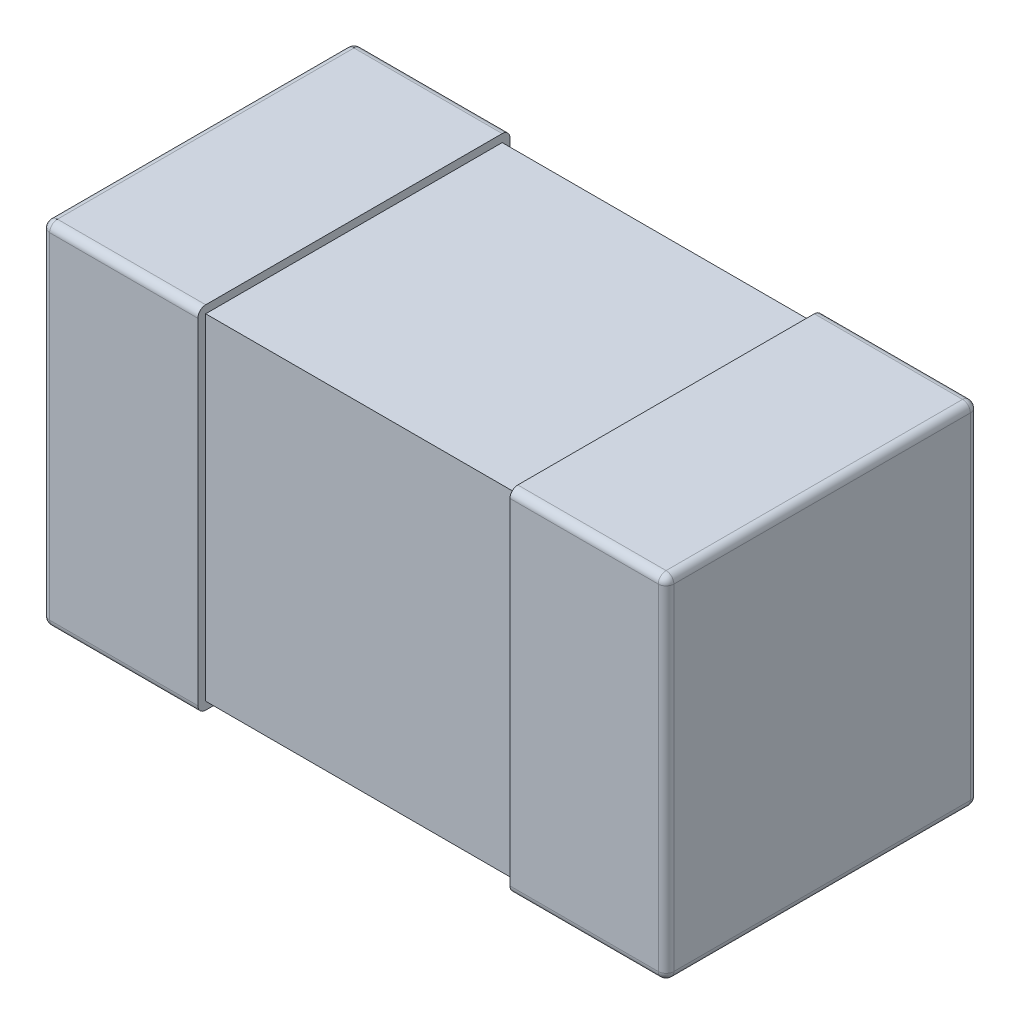
ISO-10303-21;
HEADER;
FILE_DESCRIPTION(('STEP AP214'),'2;1');
FILE_NAME('part.step','',(''),(''),'','','');
FILE_SCHEMA(('AUTOMOTIVE_DESIGN { 1 0 10303 214 1 1 1 1 }'));
ENDSEC;
DATA;
#1=APPLICATION_CONTEXT('core data for automotive mechanical design processes');
#2=APPLICATION_PROTOCOL_DEFINITION('international standard','automotive_design',2000,#1);
#3=PRODUCT_CONTEXT('',#1,'mechanical');
#4=PRODUCT('Part','Part','',(#3));
#5=PRODUCT_RELATED_PRODUCT_CATEGORY('part','',(#4));
#6=PRODUCT_DEFINITION_FORMATION('','',#4);
#7=PRODUCT_DEFINITION_CONTEXT('part definition',#1,'design');
#8=PRODUCT_DEFINITION('design','',#6,#7);
#9=PRODUCT_DEFINITION_SHAPE('','',#8);
#10=(LENGTH_UNIT() NAMED_UNIT(*) SI_UNIT(.MILLI.,.METRE.));
#11=(NAMED_UNIT(*) PLANE_ANGLE_UNIT() SI_UNIT($,.RADIAN.));
#12=(NAMED_UNIT(*) SI_UNIT($,.STERADIAN.) SOLID_ANGLE_UNIT());
#13=UNCERTAINTY_MEASURE_WITH_UNIT(LENGTH_MEASURE(1.E-05),#10,'distance_accuracy_value','');
#14=(GEOMETRIC_REPRESENTATION_CONTEXT(3) GLOBAL_UNCERTAINTY_ASSIGNED_CONTEXT((#13)) GLOBAL_UNIT_ASSIGNED_CONTEXT((#10,
#11,#12)) REPRESENTATION_CONTEXT('',''));
#15=CARTESIAN_POINT('',(0.,0.,0.));
#16=DIRECTION('',(0.,0.,1.));
#17=DIRECTION('',(1.,0.,0.));
#18=AXIS2_PLACEMENT_3D('',#15,#16,#17);
#19=CARTESIAN_POINT('',(-0.78,0.9,-0.38));
#20=DIRECTION('',(0.,-1.,0.));
#21=DIRECTION('',(0.,0.,-1.));
#22=AXIS2_PLACEMENT_3D('',#19,#20,#21);
#23=CYLINDRICAL_SURFACE('',#22,0.02);
#24=CARTESIAN_POINT('',(-0.78,0.88,-0.38));
#25=DIRECTION('',(0.,-1.,0.));
#26=DIRECTION('',(0.,0.,1.));
#27=AXIS2_PLACEMENT_3D('',#24,#25,#26);
#28=CIRCLE('',#27,0.02);
#29=CARTESIAN_POINT('',(-0.8,0.88,-0.38));
#30=VERTEX_POINT('',#29);
#31=CARTESIAN_POINT('',(-0.78,0.88,-0.4));
#32=VERTEX_POINT('',#31);
#33=EDGE_CURVE('P0_E26',#30,#32,#28,.T.);
#34=ORIENTED_EDGE('',*,*,#33,.T.);
#35=DIRECTION('',(0.,1.,0.));
#36=VECTOR('',#35,1.);
#37=CARTESIAN_POINT('',(-0.78,0.9,-0.4));
#38=LINE('',#37,#36);
#39=CARTESIAN_POINT('',(-0.78,0.02,-0.4));
#40=VERTEX_POINT('',#39);
#41=EDGE_CURVE('P0_E200',#40,#32,#38,.T.);
#42=ORIENTED_EDGE('',*,*,#41,.F.);
#43=CARTESIAN_POINT('',(-0.78,0.02,-0.38));
#44=DIRECTION('',(0.,1.,0.));
#45=DIRECTION('',(0.,0.,-1.));
#46=AXIS2_PLACEMENT_3D('',#43,#44,#45);
#47=CIRCLE('',#46,0.02);
#48=CARTESIAN_POINT('',(-0.8,0.02,-0.38));
#49=VERTEX_POINT('',#48);
#50=EDGE_CURVE('P0_E11',#40,#49,#47,.T.);
#51=ORIENTED_EDGE('',*,*,#50,.T.);
#52=DIRECTION('',(0.,-1.,0.));
#53=VECTOR('',#52,1.);
#54=CARTESIAN_POINT('',(-0.8,0.9,-0.38));
#55=LINE('',#54,#53);
#56=EDGE_CURVE('P0_E663',#30,#49,#55,.T.);
#57=ORIENTED_EDGE('',*,*,#56,.F.);
#58=EDGE_LOOP('',(#34,#42,#51,#57));
#59=FACE_BOUND('',#58,.T.);
#60=ADVANCED_FACE('P0_F16',(#59),#23,.T.);
#61=CARTESIAN_POINT('',(-0.78,0.02,-0.38));
#62=DIRECTION('',(0.,1.,0.));
#63=DIRECTION('',(1.,0.,0.));
#64=AXIS2_PLACEMENT_3D('',#61,#62,#63);
#65=SPHERICAL_SURFACE('',#64,0.02);
#66=CARTESIAN_POINT('',(-0.78,0.02,-0.38));
#67=DIRECTION('',(-1.,0.,0.));
#68=DIRECTION('',(0.,0.,1.));
#69=AXIS2_PLACEMENT_3D('',#66,#67,#68);
#70=CIRCLE('',#69,0.02);
#71=CARTESIAN_POINT('',(-0.78,0.,-0.38));
#72=VERTEX_POINT('',#71);
#73=EDGE_CURVE('P0_E40',#40,#72,#70,.T.);
#74=ORIENTED_EDGE('',*,*,#73,.T.);
#75=CARTESIAN_POINT('',(-0.78,0.02,-0.38));
#76=DIRECTION('',(0.,0.,-1.));
#77=DIRECTION('',(-1.,0.,0.));
#78=AXIS2_PLACEMENT_3D('',#75,#76,#77);
#79=CIRCLE('',#78,0.02);
#80=EDGE_CURVE('P0_E242',#72,#49,#79,.T.);
#81=ORIENTED_EDGE('',*,*,#80,.T.);
#82=ORIENTED_EDGE('',*,*,#50,.F.);
#83=EDGE_LOOP('',(#74,#81,#82));
#84=FACE_BOUND('',#83,.T.);
#85=ADVANCED_FACE('P0_F18',(#84),#65,.T.);
#86=CARTESIAN_POINT('',(-0.78,0.88,-0.38));
#87=DIRECTION('',(0.,1.,0.));
#88=DIRECTION('',(1.,0.,0.));
#89=AXIS2_PLACEMENT_3D('',#86,#87,#88);
#90=SPHERICAL_SURFACE('',#89,0.02);
#91=CARTESIAN_POINT('',(-0.78,0.88,-0.38));
#92=DIRECTION('',(0.,0.,-1.));
#93=DIRECTION('',(0.,1.,0.));
#94=AXIS2_PLACEMENT_3D('',#91,#92,#93);
#95=CIRCLE('',#94,0.02);
#96=CARTESIAN_POINT('',(-0.78,0.9,-0.38));
#97=VERTEX_POINT('',#96);
#98=EDGE_CURVE('P0_E20',#30,#97,#95,.T.);
#99=ORIENTED_EDGE('',*,*,#98,.T.);
#100=CARTESIAN_POINT('',(-0.78,0.88,-0.38));
#101=DIRECTION('',(-1.,0.,0.));
#102=DIRECTION('',(0.,0.,1.));
#103=AXIS2_PLACEMENT_3D('',#100,#101,#102);
#104=CIRCLE('',#103,0.02);
#105=EDGE_CURVE('P0_E236',#97,#32,#104,.T.);
#106=ORIENTED_EDGE('',*,*,#105,.T.);
#107=ORIENTED_EDGE('',*,*,#33,.F.);
#108=EDGE_LOOP('',(#99,#106,#107));
#109=FACE_BOUND('',#108,.T.);
#110=ADVANCED_FACE('P0_F382',(#109),#90,.T.);
#111=CARTESIAN_POINT('',(-0.8,0.02,-0.38));
#112=DIRECTION('',(1.,0.,0.));
#113=DIRECTION('',(0.,0.,-1.));
#114=AXIS2_PLACEMENT_3D('',#111,#112,#113);
#115=CYLINDRICAL_SURFACE('',#114,0.02);
#116=CARTESIAN_POINT('',(-0.4,0.02,-0.38));
#117=DIRECTION('',(1.,0.,0.));
#118=DIRECTION('',(0.,0.,1.));
#119=AXIS2_PLACEMENT_3D('',#116,#117,#118);
#120=CIRCLE('',#119,0.02);
#121=CARTESIAN_POINT('',(-0.4,0.,-0.38));
#122=VERTEX_POINT('',#121);
#123=CARTESIAN_POINT('',(-0.4,0.02,-0.4));
#124=VERTEX_POINT('',#123);
#125=EDGE_CURVE('P0_E241',#122,#124,#120,.T.);
#126=ORIENTED_EDGE('',*,*,#125,.F.);
#127=DIRECTION('',(1.,0.,0.));
#128=VECTOR('',#127,1.);
#129=CARTESIAN_POINT('',(-0.4,0.,-0.38));
#130=LINE('',#129,#128);
#131=EDGE_CURVE('P0_E205',#72,#122,#130,.T.);
#132=ORIENTED_EDGE('',*,*,#131,.F.);
#133=ORIENTED_EDGE('',*,*,#73,.F.);
#134=DIRECTION('',(-1.,0.,0.));
#135=VECTOR('',#134,1.);
#136=CARTESIAN_POINT('',(-0.8,0.02,-0.4));
#137=LINE('',#136,#135);
#138=EDGE_CURVE('P0_E154',#124,#40,#137,.T.);
#139=ORIENTED_EDGE('',*,*,#138,.F.);
#140=EDGE_LOOP('',(#126,#132,#133,#139));
#141=FACE_BOUND('',#140,.T.);
#142=ADVANCED_FACE('P0_F273',(#141),#115,.T.);
#143=CARTESIAN_POINT('',(-0.78,0.02,0.4));
#144=DIRECTION('',(0.,0.,-1.));
#145=DIRECTION('',(-1.,0.,0.));
#146=AXIS2_PLACEMENT_3D('',#143,#144,#145);
#147=CYLINDRICAL_SURFACE('',#146,0.02);
#148=CARTESIAN_POINT('',(-0.78,0.02,0.38));
#149=DIRECTION('',(0.,0.,-1.));
#150=DIRECTION('',(1.,0.,0.));
#151=AXIS2_PLACEMENT_3D('',#148,#149,#150);
#152=CIRCLE('',#151,0.02);
#153=CARTESIAN_POINT('',(-0.78,0.,0.38));
#154=VERTEX_POINT('',#153);
#155=CARTESIAN_POINT('',(-0.8,0.02,0.38));
#156=VERTEX_POINT('',#155);
#157=EDGE_CURVE('P0_E54',#154,#156,#152,.T.);
#158=ORIENTED_EDGE('',*,*,#157,.T.);
#159=DIRECTION('',(0.,0.,1.));
#160=VECTOR('',#159,1.);
#161=CARTESIAN_POINT('',(-0.8,0.02,0.4));
#162=LINE('',#161,#160);
#163=EDGE_CURVE('P0_E184',#49,#156,#162,.T.);
#164=ORIENTED_EDGE('',*,*,#163,.F.);
#165=ORIENTED_EDGE('',*,*,#80,.F.);
#166=DIRECTION('',(0.,0.,-1.));
#167=VECTOR('',#166,1.);
#168=CARTESIAN_POINT('',(-0.78,0.,-0.4));
#169=LINE('',#168,#167);
#170=EDGE_CURVE('P0_E207',#154,#72,#169,.T.);
#171=ORIENTED_EDGE('',*,*,#170,.F.);
#172=EDGE_LOOP('',(#158,#164,#165,#171));
#173=FACE_BOUND('',#172,.T.);
#174=ADVANCED_FACE('P0_F268',(#173),#147,.T.);
#175=CARTESIAN_POINT('',(-0.78,0.88,0.));
#176=DIRECTION('',(0.,0.,1.));
#177=DIRECTION('',(1.,0.,0.));
#178=AXIS2_PLACEMENT_3D('',#175,#176,#177);
#179=CYLINDRICAL_SURFACE('',#178,0.02);
#180=CARTESIAN_POINT('',(-0.78,0.88,0.38));
#181=DIRECTION('',(0.,0.,-1.));
#182=DIRECTION('',(1.,0.,0.));
#183=AXIS2_PLACEMENT_3D('',#180,#181,#182);
#184=CIRCLE('',#183,0.02);
#185=CARTESIAN_POINT('',(-0.8,0.88,0.38));
#186=VERTEX_POINT('',#185);
#187=CARTESIAN_POINT('',(-0.78,0.9,0.38));
#188=VERTEX_POINT('',#187);
#189=EDGE_CURVE('P0_E75',#186,#188,#184,.T.);
#190=ORIENTED_EDGE('',*,*,#189,.T.);
#191=DIRECTION('',(0.,0.,1.));
#192=VECTOR('',#191,1.);
#193=CARTESIAN_POINT('',(-0.78,0.9,0.));
#194=LINE('',#193,#192);
#195=EDGE_CURVE('P0_E218',#97,#188,#194,.T.);
#196=ORIENTED_EDGE('',*,*,#195,.F.);
#197=ORIENTED_EDGE('',*,*,#98,.F.);
#198=DIRECTION('',(0.,0.,-1.));
#199=VECTOR('',#198,1.);
#200=CARTESIAN_POINT('',(-0.8,0.88,0.4));
#201=LINE('',#200,#199);
#202=EDGE_CURVE('P0_E697',#186,#30,#201,.T.);
#203=ORIENTED_EDGE('',*,*,#202,.F.);
#204=EDGE_LOOP('',(#190,#196,#197,#203));
#205=FACE_BOUND('',#204,.T.);
#206=ADVANCED_FACE('P0_F442',(#205),#179,.T.);
#207=CARTESIAN_POINT('',(0.,0.88,-0.38));
#208=DIRECTION('',(-1.,0.,0.));
#209=DIRECTION('',(0.,0.,1.));
#210=AXIS2_PLACEMENT_3D('',#207,#208,#209);
#211=CYLINDRICAL_SURFACE('',#210,0.02);
#212=CARTESIAN_POINT('',(-0.4,0.88,-0.38));
#213=DIRECTION('',(1.,0.,0.));
#214=DIRECTION('',(0.,0.,1.));
#215=AXIS2_PLACEMENT_3D('',#212,#213,#214);
#216=CIRCLE('',#215,0.02);
#217=CARTESIAN_POINT('',(-0.4,0.88,-0.4));
#218=VERTEX_POINT('',#217);
#219=CARTESIAN_POINT('',(-0.4,0.9,-0.38));
#220=VERTEX_POINT('',#219);
#221=EDGE_CURVE('P0_E185',#218,#220,#216,.T.);
#222=ORIENTED_EDGE('',*,*,#221,.F.);
#223=DIRECTION('',(1.,0.,0.));
#224=VECTOR('',#223,1.);
#225=CARTESIAN_POINT('',(-0.8,0.88,-0.4));
#226=LINE('',#225,#224);
#227=EDGE_CURVE('P0_E204',#32,#218,#226,.T.);
#228=ORIENTED_EDGE('',*,*,#227,.F.);
#229=ORIENTED_EDGE('',*,*,#105,.F.);
#230=DIRECTION('',(-1.,0.,0.));
#231=VECTOR('',#230,1.);
#232=CARTESIAN_POINT('',(0.,0.9,-0.38));
#233=LINE('',#232,#231);
#234=EDGE_CURVE('P0_E209',#220,#97,#233,.T.);
#235=ORIENTED_EDGE('',*,*,#234,.F.);
#236=EDGE_LOOP('',(#222,#228,#229,#235));
#237=FACE_BOUND('',#236,.T.);
#238=ADVANCED_FACE('P0_F437',(#237),#211,.T.);
#239=CARTESIAN_POINT('',(-0.78,0.02,0.38));
#240=DIRECTION('',(0.,1.,0.));
#241=DIRECTION('',(1.,0.,0.));
#242=AXIS2_PLACEMENT_3D('',#239,#240,#241);
#243=SPHERICAL_SURFACE('',#242,0.02);
#244=CARTESIAN_POINT('',(-0.78,0.02,0.38));
#245=DIRECTION('',(-1.,0.,0.));
#246=DIRECTION('',(0.,0.,1.));
#247=AXIS2_PLACEMENT_3D('',#244,#245,#246);
#248=CIRCLE('',#247,0.02);
#249=CARTESIAN_POINT('',(-0.78,0.02,0.4));
#250=VERTEX_POINT('',#249);
#251=EDGE_CURVE('P0_E191',#154,#250,#248,.T.);
#252=ORIENTED_EDGE('',*,*,#251,.T.);
#253=CARTESIAN_POINT('',(-0.78,0.02,0.38));
#254=DIRECTION('',(0.,-1.,0.));
#255=DIRECTION('',(0.,0.,-1.));
#256=AXIS2_PLACEMENT_3D('',#253,#254,#255);
#257=CIRCLE('',#256,0.02);
#258=EDGE_CURVE('P0_E248',#250,#156,#257,.T.);
#259=ORIENTED_EDGE('',*,*,#258,.T.);
#260=ORIENTED_EDGE('',*,*,#157,.F.);
#261=EDGE_LOOP('',(#252,#259,#260));
#262=FACE_BOUND('',#261,.T.);
#263=ADVANCED_FACE('P0_F441',(#262),#243,.T.);
#264=CARTESIAN_POINT('',(-0.78,0.88,0.38));
#265=DIRECTION('',(0.,1.,0.));
#266=DIRECTION('',(1.,0.,0.));
#267=AXIS2_PLACEMENT_3D('',#264,#265,#266);
#268=SPHERICAL_SURFACE('',#267,0.02);
#269=CARTESIAN_POINT('',(-0.78,0.88,0.38));
#270=DIRECTION('',(0.,1.,0.));
#271=DIRECTION('',(0.,0.,1.));
#272=AXIS2_PLACEMENT_3D('',#269,#270,#271);
#273=CIRCLE('',#272,0.02);
#274=CARTESIAN_POINT('',(-0.78,0.88,0.4));
#275=VERTEX_POINT('',#274);
#276=EDGE_CURVE('P0_E194',#186,#275,#273,.T.);
#277=ORIENTED_EDGE('',*,*,#276,.T.);
#278=CARTESIAN_POINT('',(-0.78,0.88,0.38));
#279=DIRECTION('',(-1.,0.,0.));
#280=DIRECTION('',(0.,0.,1.));
#281=AXIS2_PLACEMENT_3D('',#278,#279,#280);
#282=CIRCLE('',#281,0.02);
#283=EDGE_CURVE('P0_E245',#275,#188,#282,.T.);
#284=ORIENTED_EDGE('',*,*,#283,.T.);
#285=ORIENTED_EDGE('',*,*,#189,.F.);
#286=EDGE_LOOP('',(#277,#284,#285));
#287=FACE_BOUND('',#286,.T.);
#288=ADVANCED_FACE('P0_F463',(#287),#268,.T.);
#289=CARTESIAN_POINT('',(-0.8,0.02,0.38));
#290=DIRECTION('',(-1.,0.,0.));
#291=DIRECTION('',(0.,0.,1.));
#292=AXIS2_PLACEMENT_3D('',#289,#290,#291);
#293=CYLINDRICAL_SURFACE('',#292,0.02);
#294=CARTESIAN_POINT('',(-0.4,0.02,0.38));
#295=DIRECTION('',(1.,0.,0.));
#296=DIRECTION('',(0.,0.,1.));
#297=AXIS2_PLACEMENT_3D('',#294,#295,#296);
#298=CIRCLE('',#297,0.02);
#299=CARTESIAN_POINT('',(-0.4,0.02,0.4));
#300=VERTEX_POINT('',#299);
#301=CARTESIAN_POINT('',(-0.4,0.,0.38));
#302=VERTEX_POINT('',#301);
#303=EDGE_CURVE('P0_E142',#300,#302,#298,.T.);
#304=ORIENTED_EDGE('',*,*,#303,.F.);
#305=DIRECTION('',(1.,0.,0.));
#306=VECTOR('',#305,1.);
#307=CARTESIAN_POINT('',(-0.4,0.02,0.4));
#308=LINE('',#307,#306);
#309=EDGE_CURVE('P0_E146',#250,#300,#308,.T.);
#310=ORIENTED_EDGE('',*,*,#309,.F.);
#311=ORIENTED_EDGE('',*,*,#251,.F.);
#312=DIRECTION('',(-1.,0.,0.));
#313=VECTOR('',#312,1.);
#314=CARTESIAN_POINT('',(-0.8,0.,0.38));
#315=LINE('',#314,#313);
#316=EDGE_CURVE('P0_E149',#302,#154,#315,.T.);
#317=ORIENTED_EDGE('',*,*,#316,.F.);
#318=EDGE_LOOP('',(#304,#310,#311,#317));
#319=FACE_BOUND('',#318,.T.);
#320=ADVANCED_FACE('P0_F144',(#319),#293,.T.);
#321=CARTESIAN_POINT('',(-0.78,0.9,0.38));
#322=DIRECTION('',(0.,-1.,0.));
#323=DIRECTION('',(0.,0.,-1.));
#324=AXIS2_PLACEMENT_3D('',#321,#322,#323);
#325=CYLINDRICAL_SURFACE('',#324,0.02);
#326=ORIENTED_EDGE('',*,*,#258,.F.);
#327=DIRECTION('',(0.,-1.,0.));
#328=VECTOR('',#327,1.);
#329=CARTESIAN_POINT('',(-0.78,0.9,0.4));
#330=LINE('',#329,#328);
#331=EDGE_CURVE('P0_E170',#275,#250,#330,.T.);
#332=ORIENTED_EDGE('',*,*,#331,.F.);
#333=ORIENTED_EDGE('',*,*,#276,.F.);
#334=DIRECTION('',(0.,1.,0.));
#335=VECTOR('',#334,1.);
#336=CARTESIAN_POINT('',(-0.8,0.9,0.38));
#337=LINE('',#336,#335);
#338=EDGE_CURVE('P0_E177',#156,#186,#337,.T.);
#339=ORIENTED_EDGE('',*,*,#338,.F.);
#340=EDGE_LOOP('',(#326,#332,#333,#339));
#341=FACE_BOUND('',#340,.T.);
#342=ADVANCED_FACE('P0_F420',(#341),#325,.T.);
#343=CARTESIAN_POINT('',(0.,0.88,0.38));
#344=DIRECTION('',(1.,0.,0.));
#345=DIRECTION('',(0.,0.,-1.));
#346=AXIS2_PLACEMENT_3D('',#343,#344,#345);
#347=CYLINDRICAL_SURFACE('',#346,0.02);
#348=CARTESIAN_POINT('',(-0.4,0.88,0.38));
#349=DIRECTION('',(1.,0.,0.));
#350=DIRECTION('',(0.,0.,1.));
#351=AXIS2_PLACEMENT_3D('',#348,#349,#350);
#352=CIRCLE('',#351,0.02);
#353=CARTESIAN_POINT('',(-0.4,0.9,0.38));
#354=VERTEX_POINT('',#353);
#355=CARTESIAN_POINT('',(-0.4,0.88,0.4));
#356=VERTEX_POINT('',#355);
#357=EDGE_CURVE('P0_E155',#354,#356,#352,.T.);
#358=ORIENTED_EDGE('',*,*,#357,.F.);
#359=DIRECTION('',(1.,0.,0.));
#360=VECTOR('',#359,1.);
#361=CARTESIAN_POINT('',(0.,0.9,0.38));
#362=LINE('',#361,#360);
#363=EDGE_CURVE('P0_E226',#188,#354,#362,.T.);
#364=ORIENTED_EDGE('',*,*,#363,.F.);
#365=ORIENTED_EDGE('',*,*,#283,.F.);
#366=DIRECTION('',(-1.,0.,0.));
#367=VECTOR('',#366,1.);
#368=CARTESIAN_POINT('',(-0.8,0.88,0.4));
#369=LINE('',#368,#367);
#370=EDGE_CURVE('P0_E166',#356,#275,#369,.T.);
#371=ORIENTED_EDGE('',*,*,#370,.F.);
#372=EDGE_LOOP('',(#358,#364,#365,#371));
#373=FACE_BOUND('',#372,.T.);
#374=ADVANCED_FACE('P0_F416',(#373),#347,.T.);
#375=CARTESIAN_POINT('',(0.,0.,0.));
#376=DIRECTION('',(0.,-1.,0.));
#377=DIRECTION('',(0.,0.,-1.));
#378=AXIS2_PLACEMENT_3D('',#375,#376,#377);
#379=PLANE('',#378);
#380=ORIENTED_EDGE('',*,*,#170,.T.);
#381=ORIENTED_EDGE('',*,*,#131,.T.);
#382=DIRECTION('',(0.,0.,-1.));
#383=VECTOR('',#382,1.);
#384=CARTESIAN_POINT('',(-0.4,0.,0.4));
#385=LINE('',#384,#383);
#386=EDGE_CURVE('P0_E233',#302,#122,#385,.T.);
#387=ORIENTED_EDGE('',*,*,#386,.F.);
#388=ORIENTED_EDGE('',*,*,#316,.T.);
#389=EDGE_LOOP('',(#380,#381,#387,#388));
#390=FACE_BOUND('',#389,.T.);
#391=ADVANCED_FACE('P0_F264',(#390),#379,.T.);
#392=CARTESIAN_POINT('',(0.,0.9,0.));
#393=DIRECTION('',(0.,-1.,0.));
#394=DIRECTION('',(0.,0.,-1.));
#395=AXIS2_PLACEMENT_3D('',#392,#393,#394);
#396=PLANE('',#395);
#397=DIRECTION('',(0.,0.,-1.));
#398=VECTOR('',#397,1.);
#399=CARTESIAN_POINT('',(-0.4,0.9,0.4));
#400=LINE('',#399,#398);
#401=EDGE_CURVE('P0_E188',#354,#220,#400,.T.);
#402=ORIENTED_EDGE('',*,*,#401,.T.);
#403=ORIENTED_EDGE('',*,*,#234,.T.);
#404=ORIENTED_EDGE('',*,*,#195,.T.);
#405=ORIENTED_EDGE('',*,*,#363,.T.);
#406=EDGE_LOOP('',(#402,#403,#404,#405));
#407=FACE_BOUND('',#406,.T.);
#408=ADVANCED_FACE('P0_F479',(#407),#396,.F.);
#409=CARTESIAN_POINT('',(-0.8,0.9,-0.4));
#410=DIRECTION('',(0.,0.,1.));
#411=DIRECTION('',(1.,0.,0.));
#412=AXIS2_PLACEMENT_3D('',#409,#410,#411);
#413=PLANE('',#412);
#414=DIRECTION('',(0.,-1.,0.));
#415=VECTOR('',#414,1.);
#416=CARTESIAN_POINT('',(-0.4,0.9,-0.4));
#417=LINE('',#416,#415);
#418=EDGE_CURVE('P0_E189',#218,#124,#417,.T.);
#419=ORIENTED_EDGE('',*,*,#418,.T.);
#420=ORIENTED_EDGE('',*,*,#138,.T.);
#421=ORIENTED_EDGE('',*,*,#41,.T.);
#422=ORIENTED_EDGE('',*,*,#227,.T.);
#423=EDGE_LOOP('',(#419,#420,#421,#422));
#424=FACE_BOUND('',#423,.T.);
#425=ADVANCED_FACE('P0_F453',(#424),#413,.F.);
#426=CARTESIAN_POINT('',(-0.4,0.9,0.4));
#427=DIRECTION('',(-1.,0.,0.));
#428=DIRECTION('',(0.,0.,1.));
#429=AXIS2_PLACEMENT_3D('',#426,#427,#428);
#430=PLANE('',#429);
#431=ORIENTED_EDGE('',*,*,#386,.T.);
#432=ORIENTED_EDGE('',*,*,#125,.T.);
#433=ORIENTED_EDGE('',*,*,#418,.F.);
#434=ORIENTED_EDGE('',*,*,#221,.T.);
#435=ORIENTED_EDGE('',*,*,#401,.F.);
#436=ORIENTED_EDGE('',*,*,#357,.T.);
#437=DIRECTION('',(0.,-1.,0.));
#438=VECTOR('',#437,1.);
#439=CARTESIAN_POINT('',(-0.4,0.9,0.4));
#440=LINE('',#439,#438);
#441=EDGE_CURVE('P0_E158',#356,#300,#440,.T.);
#442=ORIENTED_EDGE('',*,*,#441,.T.);
#443=ORIENTED_EDGE('',*,*,#303,.T.);
#444=EDGE_LOOP('',(#431,#432,#433,#434,#435,#436,#442,#443));
#445=FACE_BOUND('',#444,.T.);
#446=ADVANCED_FACE('P0_F159',(#445),#430,.F.);
#447=CARTESIAN_POINT('',(-0.8,0.9,0.4));
#448=DIRECTION('',(0.,0.,-1.));
#449=DIRECTION('',(0.,-1.,0.));
#450=AXIS2_PLACEMENT_3D('',#447,#448,#449);
#451=PLANE('',#450);
#452=ORIENTED_EDGE('',*,*,#331,.T.);
#453=ORIENTED_EDGE('',*,*,#309,.T.);
#454=ORIENTED_EDGE('',*,*,#441,.F.);
#455=ORIENTED_EDGE('',*,*,#370,.T.);
#456=EDGE_LOOP('',(#452,#453,#454,#455));
#457=FACE_BOUND('',#456,.T.);
#458=ADVANCED_FACE('P0_F168',(#457),#451,.F.);
#459=CARTESIAN_POINT('',(-0.8,0.9,0.4));
#460=DIRECTION('',(1.,0.,0.));
#461=DIRECTION('',(0.,1.,0.));
#462=AXIS2_PLACEMENT_3D('',#459,#460,#461);
#463=PLANE('',#462);
#464=ORIENTED_EDGE('',*,*,#202,.T.);
#465=ORIENTED_EDGE('',*,*,#56,.T.);
#466=ORIENTED_EDGE('',*,*,#163,.T.);
#467=ORIENTED_EDGE('',*,*,#338,.T.);
#468=EDGE_LOOP('',(#464,#465,#466,#467));
#469=FACE_BOUND('',#468,.T.);
#470=ADVANCED_FACE('P0_F391',(#469),#463,.F.);
#471=CLOSED_SHELL('',(#60,#85,#110,#142,#174,#206,#238,#263,#288,#320,#342,#374,#391,#408,#425,
#446,#458,#470));
#472=MANIFOLD_SOLID_BREP('P0_B1',#471);
#473=CARTESIAN_POINT('',(0.78,0.9,-0.38));
#474=DIRECTION('',(0.,-1.,0.));
#475=DIRECTION('',(0.,0.,-1.));
#476=AXIS2_PLACEMENT_3D('',#473,#474,#475);
#477=CYLINDRICAL_SURFACE('',#476,0.02);
#478=CARTESIAN_POINT('',(0.78,0.88,-0.38));
#479=DIRECTION('',(0.,1.,0.));
#480=DIRECTION('',(0.,0.,1.));
#481=AXIS2_PLACEMENT_3D('',#478,#479,#480);
#482=CIRCLE('',#481,0.02);
#483=CARTESIAN_POINT('',(0.8,0.88,-0.38));
#484=VERTEX_POINT('',#483);
#485=CARTESIAN_POINT('',(0.78,0.88,-0.4));
#486=VERTEX_POINT('',#485);
#487=EDGE_CURVE('P1_E27',#484,#486,#482,.T.);
#488=ORIENTED_EDGE('',*,*,#487,.F.);
#489=DIRECTION('',(0.,-1.,0.));
#490=VECTOR('',#489,1.);
#491=CARTESIAN_POINT('',(0.8,0.9,-0.38));
#492=LINE('',#491,#490);
#493=CARTESIAN_POINT('',(0.8,0.02,-0.38));
#494=VERTEX_POINT('',#493);
#495=EDGE_CURVE('P1_E181',#484,#494,#492,.T.);
#496=ORIENTED_EDGE('',*,*,#495,.T.);
#497=CARTESIAN_POINT('',(0.78,0.02,-0.38));
#498=DIRECTION('',(0.,-1.,0.));
#499=DIRECTION('',(0.,0.,-1.));
#500=AXIS2_PLACEMENT_3D('',#497,#498,#499);
#501=CIRCLE('',#500,0.02);
#502=CARTESIAN_POINT('',(0.78,0.02,-0.4));
#503=VERTEX_POINT('',#502);
#504=EDGE_CURVE('P1_E11',#503,#494,#501,.T.);
#505=ORIENTED_EDGE('',*,*,#504,.F.);
#506=DIRECTION('',(0.,1.,0.));
#507=VECTOR('',#506,1.);
#508=CARTESIAN_POINT('',(0.78,0.9,-0.4));
#509=LINE('',#508,#507);
#510=EDGE_CURVE('P1_E159',#503,#486,#509,.T.);
#511=ORIENTED_EDGE('',*,*,#510,.T.);
#512=EDGE_LOOP('',(#488,#496,#505,#511));
#513=FACE_BOUND('',#512,.T.);
#514=ADVANCED_FACE('P1_F16',(#513),#477,.T.);
#515=CARTESIAN_POINT('',(0.78,0.02,-0.38));
#516=DIRECTION('',(0.,-1.,0.));
#517=DIRECTION('',(-1.,0.,0.));
#518=AXIS2_PLACEMENT_3D('',#515,#516,#517);
#519=SPHERICAL_SURFACE('',#518,0.02);
#520=CARTESIAN_POINT('',(0.78,0.02,-0.38));
#521=DIRECTION('',(-1.,0.,0.));
#522=DIRECTION('',(0.,0.,1.));
#523=AXIS2_PLACEMENT_3D('',#520,#521,#522);
#524=CIRCLE('',#523,0.02);
#525=CARTESIAN_POINT('',(0.78,0.,-0.38));
#526=VERTEX_POINT('',#525);
#527=EDGE_CURVE('P1_E42',#503,#526,#524,.T.);
#528=ORIENTED_EDGE('',*,*,#527,.F.);
#529=ORIENTED_EDGE('',*,*,#504,.T.);
#530=CARTESIAN_POINT('',(0.78,0.02,-0.38));
#531=DIRECTION('',(0.,0.,1.));
#532=DIRECTION('',(1.,0.,0.));
#533=AXIS2_PLACEMENT_3D('',#530,#531,#532);
#534=CIRCLE('',#533,0.02);
#535=EDGE_CURVE('P1_E198',#526,#494,#534,.T.);
#536=ORIENTED_EDGE('',*,*,#535,.F.);
#537=EDGE_LOOP('',(#528,#529,#536));
#538=FACE_BOUND('',#537,.T.);
#539=ADVANCED_FACE('P1_F403',(#538),#519,.T.);
#540=CARTESIAN_POINT('',(0.78,0.88,-0.38));
#541=DIRECTION('',(0.,-1.,0.));
#542=DIRECTION('',(-1.,0.,0.));
#543=AXIS2_PLACEMENT_3D('',#540,#541,#542);
#544=SPHERICAL_SURFACE('',#543,0.02);
#545=CARTESIAN_POINT('',(0.78,0.88,-0.38));
#546=DIRECTION('',(0.,0.,1.));
#547=DIRECTION('',(0.,1.,0.));
#548=AXIS2_PLACEMENT_3D('',#545,#546,#547);
#549=CIRCLE('',#548,0.02);
#550=CARTESIAN_POINT('',(0.78,0.9,-0.38));
#551=VERTEX_POINT('',#550);
#552=EDGE_CURVE('P1_E141',#484,#551,#549,.T.);
#553=ORIENTED_EDGE('',*,*,#552,.F.);
#554=ORIENTED_EDGE('',*,*,#487,.T.);
#555=CARTESIAN_POINT('',(0.78,0.88,-0.38));
#556=DIRECTION('',(-1.,0.,0.));
#557=DIRECTION('',(0.,0.,1.));
#558=AXIS2_PLACEMENT_3D('',#555,#556,#557);
#559=CIRCLE('',#558,0.02);
#560=EDGE_CURVE('P1_E193',#551,#486,#559,.T.);
#561=ORIENTED_EDGE('',*,*,#560,.F.);
#562=EDGE_LOOP('',(#553,#554,#561));
#563=FACE_BOUND('',#562,.T.);
#564=ADVANCED_FACE('P1_F308',(#563),#544,.T.);
#565=CARTESIAN_POINT('',(0.8,0.02,-0.38));
#566=DIRECTION('',(-1.,0.,0.));
#567=DIRECTION('',(0.,0.,-1.));
#568=AXIS2_PLACEMENT_3D('',#565,#566,#567);
#569=CYLINDRICAL_SURFACE('',#568,0.02);
#570=CARTESIAN_POINT('',(0.4,0.02,-0.38));
#571=DIRECTION('',(1.,0.,0.));
#572=DIRECTION('',(0.,0.,1.));
#573=AXIS2_PLACEMENT_3D('',#570,#571,#572);
#574=CIRCLE('',#573,0.02);
#575=CARTESIAN_POINT('',(0.4,0.,-0.38));
#576=VERTEX_POINT('',#575);
#577=CARTESIAN_POINT('',(0.4,0.02,-0.4));
#578=VERTEX_POINT('',#577);
#579=EDGE_CURVE('P1_E202',#576,#578,#574,.T.);
#580=ORIENTED_EDGE('',*,*,#579,.T.);
#581=DIRECTION('',(1.,0.,0.));
#582=VECTOR('',#581,1.);
#583=CARTESIAN_POINT('',(0.8,0.02,-0.4));
#584=LINE('',#583,#582);
#585=EDGE_CURVE('P1_E153',#578,#503,#584,.T.);
#586=ORIENTED_EDGE('',*,*,#585,.T.);
#587=ORIENTED_EDGE('',*,*,#527,.T.);
#588=DIRECTION('',(-1.,0.,0.));
#589=VECTOR('',#588,1.);
#590=CARTESIAN_POINT('',(0.4,0.,-0.38));
#591=LINE('',#590,#589);
#592=EDGE_CURVE('P1_E135',#526,#576,#591,.T.);
#593=ORIENTED_EDGE('',*,*,#592,.T.);
#594=EDGE_LOOP('',(#580,#586,#587,#593));
#595=FACE_BOUND('',#594,.T.);
#596=ADVANCED_FACE('P1_F278',(#595),#569,.T.);
#597=CARTESIAN_POINT('',(0.78,0.02,0.4));
#598=DIRECTION('',(0.,0.,-1.));
#599=DIRECTION('',(1.,0.,0.));
#600=AXIS2_PLACEMENT_3D('',#597,#598,#599);
#601=CYLINDRICAL_SURFACE('',#600,0.02);
#602=CARTESIAN_POINT('',(0.78,0.02,0.38));
#603=DIRECTION('',(0.,0.,1.));
#604=DIRECTION('',(-1.,0.,0.));
#605=AXIS2_PLACEMENT_3D('',#602,#603,#604);
#606=CIRCLE('',#605,0.02);
#607=CARTESIAN_POINT('',(0.78,0.,0.38));
#608=VERTEX_POINT('',#607);
#609=CARTESIAN_POINT('',(0.8,0.02,0.38));
#610=VERTEX_POINT('',#609);
#611=EDGE_CURVE('P1_E20',#608,#610,#606,.T.);
#612=ORIENTED_EDGE('',*,*,#611,.F.);
#613=DIRECTION('',(0.,0.,-1.));
#614=VECTOR('',#613,1.);
#615=CARTESIAN_POINT('',(0.78,0.,-0.4));
#616=LINE('',#615,#614);
#617=EDGE_CURVE('P1_E172',#608,#526,#616,.T.);
#618=ORIENTED_EDGE('',*,*,#617,.T.);
#619=ORIENTED_EDGE('',*,*,#535,.T.);
#620=DIRECTION('',(0.,0.,1.));
#621=VECTOR('',#620,1.);
#622=CARTESIAN_POINT('',(0.8,0.02,0.4));
#623=LINE('',#622,#621);
#624=EDGE_CURVE('P1_E186',#494,#610,#623,.T.);
#625=ORIENTED_EDGE('',*,*,#624,.T.);
#626=EDGE_LOOP('',(#612,#618,#619,#625));
#627=FACE_BOUND('',#626,.T.);
#628=ADVANCED_FACE('P1_F286',(#627),#601,.T.);
#629=CARTESIAN_POINT('',(0.78,0.88,0.));
#630=DIRECTION('',(0.,0.,1.));
#631=DIRECTION('',(-1.,0.,0.));
#632=AXIS2_PLACEMENT_3D('',#629,#630,#631);
#633=CYLINDRICAL_SURFACE('',#632,0.02);
#634=CARTESIAN_POINT('',(0.78,0.88,0.38));
#635=DIRECTION('',(0.,0.,1.));
#636=DIRECTION('',(-1.,0.,0.));
#637=AXIS2_PLACEMENT_3D('',#634,#635,#636);
#638=CIRCLE('',#637,0.02);
#639=CARTESIAN_POINT('',(0.8,0.88,0.38));
#640=VERTEX_POINT('',#639);
#641=CARTESIAN_POINT('',(0.78,0.9,0.38));
#642=VERTEX_POINT('',#641);
#643=EDGE_CURVE('P1_E113',#640,#642,#638,.T.);
#644=ORIENTED_EDGE('',*,*,#643,.F.);
#645=DIRECTION('',(0.,0.,-1.));
#646=VECTOR('',#645,1.);
#647=CARTESIAN_POINT('',(0.8,0.88,0.4));
#648=LINE('',#647,#646);
#649=EDGE_CURVE('P1_E168',#640,#484,#648,.T.);
#650=ORIENTED_EDGE('',*,*,#649,.T.);
#651=ORIENTED_EDGE('',*,*,#552,.T.);
#652=DIRECTION('',(0.,0.,1.));
#653=VECTOR('',#652,1.);
#654=CARTESIAN_POINT('',(0.78,0.9,0.));
#655=LINE('',#654,#653);
#656=EDGE_CURVE('P1_E138',#551,#642,#655,.T.);
#657=ORIENTED_EDGE('',*,*,#656,.T.);
#658=EDGE_LOOP('',(#644,#650,#651,#657));
#659=FACE_BOUND('',#658,.T.);
#660=ADVANCED_FACE('P1_F139',(#659),#633,.T.);
#661=CARTESIAN_POINT('',(0.,0.88,-0.38));
#662=DIRECTION('',(1.,0.,0.));
#663=DIRECTION('',(0.,0.,1.));
#664=AXIS2_PLACEMENT_3D('',#661,#662,#663);
#665=CYLINDRICAL_SURFACE('',#664,0.02);
#666=CARTESIAN_POINT('',(0.4,0.88,-0.38));
#667=DIRECTION('',(1.,0.,0.));
#668=DIRECTION('',(0.,0.,1.));
#669=AXIS2_PLACEMENT_3D('',#666,#667,#668);
#670=CIRCLE('',#669,0.02);
#671=CARTESIAN_POINT('',(0.4,0.88,-0.4));
#672=VERTEX_POINT('',#671);
#673=CARTESIAN_POINT('',(0.4,0.9,-0.38));
#674=VERTEX_POINT('',#673);
#675=EDGE_CURVE('P1_E179',#672,#674,#670,.T.);
#676=ORIENTED_EDGE('',*,*,#675,.T.);
#677=DIRECTION('',(1.,0.,0.));
#678=VECTOR('',#677,1.);
#679=CARTESIAN_POINT('',(0.,0.9,-0.38));
#680=LINE('',#679,#678);
#681=EDGE_CURVE('P1_E146',#674,#551,#680,.T.);
#682=ORIENTED_EDGE('',*,*,#681,.T.);
#683=ORIENTED_EDGE('',*,*,#560,.T.);
#684=DIRECTION('',(-1.,0.,0.));
#685=VECTOR('',#684,1.);
#686=CARTESIAN_POINT('',(0.8,0.88,-0.4));
#687=LINE('',#686,#685);
#688=EDGE_CURVE('P1_E212',#486,#672,#687,.T.);
#689=ORIENTED_EDGE('',*,*,#688,.T.);
#690=EDGE_LOOP('',(#676,#682,#683,#689));
#691=FACE_BOUND('',#690,.T.);
#692=ADVANCED_FACE('P1_F309',(#691),#665,.T.);
#693=CARTESIAN_POINT('',(0.78,0.02,0.38));
#694=DIRECTION('',(0.,-1.,0.));
#695=DIRECTION('',(-1.,0.,0.));
#696=AXIS2_PLACEMENT_3D('',#693,#694,#695);
#697=SPHERICAL_SURFACE('',#696,0.02);
#698=CARTESIAN_POINT('',(0.78,0.02,0.38));
#699=DIRECTION('',(-1.,0.,0.));
#700=DIRECTION('',(0.,0.,1.));
#701=AXIS2_PLACEMENT_3D('',#698,#699,#700);
#702=CIRCLE('',#701,0.02);
#703=CARTESIAN_POINT('',(0.78,0.02,0.4));
#704=VERTEX_POINT('',#703);
#705=EDGE_CURVE('P1_E124',#608,#704,#702,.T.);
#706=ORIENTED_EDGE('',*,*,#705,.F.);
#707=ORIENTED_EDGE('',*,*,#611,.T.);
#708=CARTESIAN_POINT('',(0.78,0.02,0.38));
#709=DIRECTION('',(0.,1.,0.));
#710=DIRECTION('',(0.,0.,-1.));
#711=AXIS2_PLACEMENT_3D('',#708,#709,#710);
#712=CIRCLE('',#711,0.02);
#713=EDGE_CURVE('P1_E134',#704,#610,#712,.T.);
#714=ORIENTED_EDGE('',*,*,#713,.F.);
#715=EDGE_LOOP('',(#706,#707,#714));
#716=FACE_BOUND('',#715,.T.);
#717=ADVANCED_FACE('P1_F291',(#716),#697,.T.);
#718=CARTESIAN_POINT('',(0.78,0.88,0.38));
#719=DIRECTION('',(0.,-1.,0.));
#720=DIRECTION('',(-1.,0.,0.));
#721=AXIS2_PLACEMENT_3D('',#718,#719,#720);
#722=SPHERICAL_SURFACE('',#721,0.02);
#723=CARTESIAN_POINT('',(0.78,0.88,0.38));
#724=DIRECTION('',(0.,-1.,0.));
#725=DIRECTION('',(0.,0.,1.));
#726=AXIS2_PLACEMENT_3D('',#723,#724,#725);
#727=CIRCLE('',#726,0.02);
#728=CARTESIAN_POINT('',(0.78,0.88,0.4));
#729=VERTEX_POINT('',#728);
#730=EDGE_CURVE('P1_E118',#640,#729,#727,.T.);
#731=ORIENTED_EDGE('',*,*,#730,.F.);
#732=ORIENTED_EDGE('',*,*,#643,.T.);
#733=CARTESIAN_POINT('',(0.78,0.88,0.38));
#734=DIRECTION('',(-1.,0.,0.));
#735=DIRECTION('',(0.,0.,1.));
#736=AXIS2_PLACEMENT_3D('',#733,#734,#735);
#737=CIRCLE('',#736,0.02);
#738=EDGE_CURVE('P1_E116',#729,#642,#737,.T.);
#739=ORIENTED_EDGE('',*,*,#738,.F.);
#740=EDGE_LOOP('',(#731,#732,#739));
#741=FACE_BOUND('',#740,.T.);
#742=ADVANCED_FACE('P1_F115',(#741),#722,.T.);
#743=CARTESIAN_POINT('',(0.8,0.02,0.38));
#744=DIRECTION('',(1.,0.,0.));
#745=DIRECTION('',(0.,0.,1.));
#746=AXIS2_PLACEMENT_3D('',#743,#744,#745);
#747=CYLINDRICAL_SURFACE('',#746,0.02);
#748=CARTESIAN_POINT('',(0.4,0.02,0.38));
#749=DIRECTION('',(1.,0.,0.));
#750=DIRECTION('',(0.,0.,1.));
#751=AXIS2_PLACEMENT_3D('',#748,#749,#750);
#752=CIRCLE('',#751,0.02);
#753=CARTESIAN_POINT('',(0.4,0.02,0.4));
#754=VERTEX_POINT('',#753);
#755=CARTESIAN_POINT('',(0.4,0.,0.38));
#756=VERTEX_POINT('',#755);
#757=EDGE_CURVE('P1_E221',#754,#756,#752,.T.);
#758=ORIENTED_EDGE('',*,*,#757,.T.);
#759=DIRECTION('',(1.,0.,0.));
#760=VECTOR('',#759,1.);
#761=CARTESIAN_POINT('',(0.8,0.,0.38));
#762=LINE('',#761,#760);
#763=EDGE_CURVE('P1_E176',#756,#608,#762,.T.);
#764=ORIENTED_EDGE('',*,*,#763,.T.);
#765=ORIENTED_EDGE('',*,*,#705,.T.);
#766=DIRECTION('',(-1.,0.,0.));
#767=VECTOR('',#766,1.);
#768=CARTESIAN_POINT('',(0.4,0.02,0.4));
#769=LINE('',#768,#767);
#770=EDGE_CURVE('P1_E163',#704,#754,#769,.T.);
#771=ORIENTED_EDGE('',*,*,#770,.T.);
#772=EDGE_LOOP('',(#758,#764,#765,#771));
#773=FACE_BOUND('',#772,.T.);
#774=ADVANCED_FACE('P1_F281',(#773),#747,.T.);
#775=CARTESIAN_POINT('',(0.78,0.9,0.38));
#776=DIRECTION('',(0.,-1.,0.));
#777=DIRECTION('',(0.,0.,-1.));
#778=AXIS2_PLACEMENT_3D('',#775,#776,#777);
#779=CYLINDRICAL_SURFACE('',#778,0.02);
#780=ORIENTED_EDGE('',*,*,#713,.T.);
#781=DIRECTION('',(0.,1.,0.));
#782=VECTOR('',#781,1.);
#783=CARTESIAN_POINT('',(0.8,0.9,0.38));
#784=LINE('',#783,#782);
#785=EDGE_CURVE('P1_E171',#610,#640,#784,.T.);
#786=ORIENTED_EDGE('',*,*,#785,.T.);
#787=ORIENTED_EDGE('',*,*,#730,.T.);
#788=DIRECTION('',(0.,-1.,0.));
#789=VECTOR('',#788,1.);
#790=CARTESIAN_POINT('',(0.78,0.9,0.4));
#791=LINE('',#790,#789);
#792=EDGE_CURVE('P1_E185',#729,#704,#791,.T.);
#793=ORIENTED_EDGE('',*,*,#792,.T.);
#794=EDGE_LOOP('',(#780,#786,#787,#793));
#795=FACE_BOUND('',#794,.T.);
#796=ADVANCED_FACE('P1_F295',(#795),#779,.T.);
#797=CARTESIAN_POINT('',(0.,0.88,0.38));
#798=DIRECTION('',(-1.,0.,0.));
#799=DIRECTION('',(0.,0.,-1.));
#800=AXIS2_PLACEMENT_3D('',#797,#798,#799);
#801=CYLINDRICAL_SURFACE('',#800,0.02);
#802=CARTESIAN_POINT('',(0.4,0.88,0.38));
#803=DIRECTION('',(1.,0.,0.));
#804=DIRECTION('',(0.,0.,1.));
#805=AXIS2_PLACEMENT_3D('',#802,#803,#804);
#806=CIRCLE('',#805,0.02);
#807=CARTESIAN_POINT('',(0.4,0.9,0.38));
#808=VERTEX_POINT('',#807);
#809=CARTESIAN_POINT('',(0.4,0.88,0.4));
#810=VERTEX_POINT('',#809);
#811=EDGE_CURVE('P1_E180',#808,#810,#806,.T.);
#812=ORIENTED_EDGE('',*,*,#811,.T.);
#813=DIRECTION('',(1.,0.,0.));
#814=VECTOR('',#813,1.);
#815=CARTESIAN_POINT('',(0.8,0.88,0.4));
#816=LINE('',#815,#814);
#817=EDGE_CURVE('P1_E131',#810,#729,#816,.T.);
#818=ORIENTED_EDGE('',*,*,#817,.T.);
#819=ORIENTED_EDGE('',*,*,#738,.T.);
#820=DIRECTION('',(-1.,0.,0.));
#821=VECTOR('',#820,1.);
#822=CARTESIAN_POINT('',(0.,0.9,0.38));
#823=LINE('',#822,#821);
#824=EDGE_CURVE('P1_E128',#642,#808,#823,.T.);
#825=ORIENTED_EDGE('',*,*,#824,.T.);
#826=EDGE_LOOP('',(#812,#818,#819,#825));
#827=FACE_BOUND('',#826,.T.);
#828=ADVANCED_FACE('P1_F18',(#827),#801,.T.);
#829=CARTESIAN_POINT('',(0.,0.,0.));
#830=DIRECTION('',(0.,-1.,0.));
#831=DIRECTION('',(0.,0.,-1.));
#832=AXIS2_PLACEMENT_3D('',#829,#830,#831);
#833=PLANE('',#832);
#834=ORIENTED_EDGE('',*,*,#617,.F.);
#835=ORIENTED_EDGE('',*,*,#763,.F.);
#836=DIRECTION('',(0.,0.,-1.));
#837=VECTOR('',#836,1.);
#838=CARTESIAN_POINT('',(0.4,0.,0.4));
#839=LINE('',#838,#837);
#840=EDGE_CURVE('P1_E223',#756,#576,#839,.T.);
#841=ORIENTED_EDGE('',*,*,#840,.T.);
#842=ORIENTED_EDGE('',*,*,#592,.F.);
#843=EDGE_LOOP('',(#834,#835,#841,#842));
#844=FACE_BOUND('',#843,.T.);
#845=ADVANCED_FACE('P1_F284',(#844),#833,.T.);
#846=CARTESIAN_POINT('',(0.,0.9,0.));
#847=DIRECTION('',(0.,-1.,0.));
#848=DIRECTION('',(0.,0.,-1.));
#849=AXIS2_PLACEMENT_3D('',#846,#847,#848);
#850=PLANE('',#849);
#851=DIRECTION('',(0.,0.,-1.));
#852=VECTOR('',#851,1.);
#853=CARTESIAN_POINT('',(0.4,0.9,0.4));
#854=LINE('',#853,#852);
#855=EDGE_CURVE('P1_E150',#808,#674,#854,.T.);
#856=ORIENTED_EDGE('',*,*,#855,.F.);
#857=ORIENTED_EDGE('',*,*,#824,.F.);
#858=ORIENTED_EDGE('',*,*,#656,.F.);
#859=ORIENTED_EDGE('',*,*,#681,.F.);
#860=EDGE_LOOP('',(#856,#857,#858,#859));
#861=FACE_BOUND('',#860,.T.);
#862=ADVANCED_FACE('P1_F148',(#861),#850,.F.);
#863=CARTESIAN_POINT('',(0.8,0.9,-0.4));
#864=DIRECTION('',(0.,0.,1.));
#865=DIRECTION('',(1.,0.,0.));
#866=AXIS2_PLACEMENT_3D('',#863,#864,#865);
#867=PLANE('',#866);
#868=DIRECTION('',(0.,-1.,0.));
#869=VECTOR('',#868,1.);
#870=CARTESIAN_POINT('',(0.4,0.9,-0.4));
#871=LINE('',#870,#869);
#872=EDGE_CURVE('P1_E199',#672,#578,#871,.T.);
#873=ORIENTED_EDGE('',*,*,#872,.F.);
#874=ORIENTED_EDGE('',*,*,#688,.F.);
#875=ORIENTED_EDGE('',*,*,#510,.F.);
#876=ORIENTED_EDGE('',*,*,#585,.F.);
#877=EDGE_LOOP('',(#873,#874,#875,#876));
#878=FACE_BOUND('',#877,.T.);
#879=ADVANCED_FACE('P1_F337',(#878),#867,.F.);
#880=CARTESIAN_POINT('',(0.4,0.9,0.4));
#881=DIRECTION('',(1.,0.,0.));
#882=DIRECTION('',(0.,1.,0.));
#883=AXIS2_PLACEMENT_3D('',#880,#881,#882);
#884=PLANE('',#883);
#885=ORIENTED_EDGE('',*,*,#840,.F.);
#886=ORIENTED_EDGE('',*,*,#757,.F.);
#887=DIRECTION('',(0.,-1.,0.));
#888=VECTOR('',#887,1.);
#889=CARTESIAN_POINT('',(0.4,0.9,0.4));
#890=LINE('',#889,#888);
#891=EDGE_CURVE('P1_E235',#810,#754,#890,.T.);
#892=ORIENTED_EDGE('',*,*,#891,.F.);
#893=ORIENTED_EDGE('',*,*,#811,.F.);
#894=ORIENTED_EDGE('',*,*,#855,.T.);
#895=ORIENTED_EDGE('',*,*,#675,.F.);
#896=ORIENTED_EDGE('',*,*,#872,.T.);
#897=ORIENTED_EDGE('',*,*,#579,.F.);
#898=EDGE_LOOP('',(#885,#886,#892,#893,#894,#895,#896,#897));
#899=FACE_BOUND('',#898,.T.);
#900=ADVANCED_FACE('P1_F280',(#899),#884,.F.);
#901=CARTESIAN_POINT('',(0.8,0.9,0.4));
#902=DIRECTION('',(0.,0.,-1.));
#903=DIRECTION('',(0.,-1.,0.));
#904=AXIS2_PLACEMENT_3D('',#901,#902,#903);
#905=PLANE('',#904);
#906=ORIENTED_EDGE('',*,*,#792,.F.);
#907=ORIENTED_EDGE('',*,*,#817,.F.);
#908=ORIENTED_EDGE('',*,*,#891,.T.);
#909=ORIENTED_EDGE('',*,*,#770,.F.);
#910=EDGE_LOOP('',(#906,#907,#908,#909));
#911=FACE_BOUND('',#910,.T.);
#912=ADVANCED_FACE('P1_F294',(#911),#905,.F.);
#913=CARTESIAN_POINT('',(0.8,0.9,0.4));
#914=DIRECTION('',(-1.,0.,0.));
#915=DIRECTION('',(0.,0.,1.));
#916=AXIS2_PLACEMENT_3D('',#913,#914,#915);
#917=PLANE('',#916);
#918=ORIENTED_EDGE('',*,*,#649,.F.);
#919=ORIENTED_EDGE('',*,*,#785,.F.);
#920=ORIENTED_EDGE('',*,*,#624,.F.);
#921=ORIENTED_EDGE('',*,*,#495,.F.);
#922=EDGE_LOOP('',(#918,#919,#920,#921));
#923=FACE_BOUND('',#922,.T.);
#924=ADVANCED_FACE('P1_F299',(#923),#917,.F.);
#925=CLOSED_SHELL('',(#514,#539,#564,#596,#628,#660,#692,#717,#742,#774,#796,#828,#845,#862,
#879,#900,#912,#924));
#926=MANIFOLD_SOLID_BREP('P1_B1',#925);
#927=CARTESIAN_POINT('',(0.4,0.9,0.4));
#928=DIRECTION('',(1.,0.,0.));
#929=DIRECTION('',(0.,1.,0.));
#930=AXIS2_PLACEMENT_3D('',#927,#928,#929);
#931=PLANE('',#930);
#932=DIRECTION('',(0.,0.,1.));
#933=VECTOR('',#932,1.);
#934=CARTESIAN_POINT('',(0.4,0.88,-0.38));
#935=LINE('',#934,#933);
#936=CARTESIAN_POINT('',(0.4,0.88,-0.38));
#937=VERTEX_POINT('',#936);
#938=CARTESIAN_POINT('',(0.4,0.88,0.38));
#939=VERTEX_POINT('',#938);
#940=EDGE_CURVE('P2_E27',#937,#939,#935,.T.);
#941=ORIENTED_EDGE('',*,*,#940,.T.);
#942=DIRECTION('',(0.,-1.,0.));
#943=VECTOR('',#942,1.);
#944=CARTESIAN_POINT('',(0.4,0.88,0.38));
#945=LINE('',#944,#943);
#946=CARTESIAN_POINT('',(0.4,0.02,0.38));
#947=VERTEX_POINT('',#946);
#948=EDGE_CURVE('P2_E98',#939,#947,#945,.T.);
#949=ORIENTED_EDGE('',*,*,#948,.T.);
#950=DIRECTION('',(0.,0.,-1.));
#951=VECTOR('',#950,1.);
#952=CARTESIAN_POINT('',(0.4,0.02,0.38));
#953=LINE('',#952,#951);
#954=CARTESIAN_POINT('',(0.4,0.02,-0.38));
#955=VERTEX_POINT('',#954);
#956=EDGE_CURVE('P2_E90',#947,#955,#953,.T.);
#957=ORIENTED_EDGE('',*,*,#956,.T.);
#958=DIRECTION('',(0.,1.,0.));
#959=VECTOR('',#958,1.);
#960=CARTESIAN_POINT('',(0.4,0.02,-0.38));
#961=LINE('',#960,#959);
#962=EDGE_CURVE('P2_E67',#955,#937,#961,.T.);
#963=ORIENTED_EDGE('',*,*,#962,.T.);
#964=EDGE_LOOP('',(#941,#949,#957,#963));
#965=FACE_BOUND('',#964,.T.);
#966=ADVANCED_FACE('P2_F16',(#965),#931,.T.);
#967=CARTESIAN_POINT('',(-0.4,0.,0.));
#968=DIRECTION('',(1.,0.,0.));
#969=DIRECTION('',(0.,1.,0.));
#970=AXIS2_PLACEMENT_3D('',#967,#968,#969);
#971=PLANE('',#970);
#972=DIRECTION('',(0.,-1.,0.));
#973=VECTOR('',#972,1.);
#974=CARTESIAN_POINT('',(-0.4,0.88,0.38));
#975=LINE('',#974,#973);
#976=CARTESIAN_POINT('',(-0.4,0.88,0.38));
#977=VERTEX_POINT('',#976);
#978=CARTESIAN_POINT('',(-0.4,0.02,0.38));
#979=VERTEX_POINT('',#978);
#980=EDGE_CURVE('P2_E111',#977,#979,#975,.T.);
#981=ORIENTED_EDGE('',*,*,#980,.F.);
#982=DIRECTION('',(0.,0.,1.));
#983=VECTOR('',#982,1.);
#984=CARTESIAN_POINT('',(-0.4,0.88,-0.38));
#985=LINE('',#984,#983);
#986=CARTESIAN_POINT('',(-0.4,0.88,-0.38));
#987=VERTEX_POINT('',#986);
#988=EDGE_CURVE('P2_E10',#987,#977,#985,.T.);
#989=ORIENTED_EDGE('',*,*,#988,.F.);
#990=DIRECTION('',(0.,1.,0.));
#991=VECTOR('',#990,1.);
#992=CARTESIAN_POINT('',(-0.4,0.02,-0.38));
#993=LINE('',#992,#991);
#994=CARTESIAN_POINT('',(-0.4,0.02,-0.38));
#995=VERTEX_POINT('',#994);
#996=EDGE_CURVE('P2_E20',#995,#987,#993,.T.);
#997=ORIENTED_EDGE('',*,*,#996,.F.);
#998=DIRECTION('',(0.,0.,-1.));
#999=VECTOR('',#998,1.);
#1000=CARTESIAN_POINT('',(-0.4,0.02,0.38));
#1001=LINE('',#1000,#999);
#1002=EDGE_CURVE('P2_E75',#979,#995,#1001,.T.);
#1003=ORIENTED_EDGE('',*,*,#1002,.F.);
#1004=EDGE_LOOP('',(#981,#989,#997,#1003));
#1005=FACE_BOUND('',#1004,.T.);
#1006=ADVANCED_FACE('P2_F73',(#1005),#971,.F.);
#1007=CARTESIAN_POINT('',(1.54769333883228,0.88,-0.38));
#1008=DIRECTION('',(0.,-1.,0.));
#1009=DIRECTION('',(0.,0.,-1.));
#1010=AXIS2_PLACEMENT_3D('',#1007,#1008,#1009);
#1011=PLANE('',#1010);
#1012=ORIENTED_EDGE('',*,*,#940,.F.);
#1013=DIRECTION('',(-1.,0.,0.));
#1014=VECTOR('',#1013,1.);
#1015=CARTESIAN_POINT('',(1.54769333883228,0.88,-0.38));
#1016=LINE('',#1015,#1014);
#1017=EDGE_CURVE('P2_E78',#937,#987,#1016,.T.);
#1018=ORIENTED_EDGE('',*,*,#1017,.T.);
#1019=ORIENTED_EDGE('',*,*,#988,.T.);
#1020=DIRECTION('',(-1.,0.,0.));
#1021=VECTOR('',#1020,1.);
#1022=CARTESIAN_POINT('',(1.54769333883228,0.88,0.38));
#1023=LINE('',#1022,#1021);
#1024=EDGE_CURVE('P2_E102',#939,#977,#1023,.T.);
#1025=ORIENTED_EDGE('',*,*,#1024,.F.);
#1026=EDGE_LOOP('',(#1012,#1018,#1019,#1025));
#1027=FACE_BOUND('',#1026,.T.);
#1028=ADVANCED_FACE('P2_F123',(#1027),#1011,.F.);
#1029=CARTESIAN_POINT('',(1.54769333883228,0.02,-0.38));
#1030=DIRECTION('',(0.,0.,1.));
#1031=DIRECTION('',(0.,-1.,0.));
#1032=AXIS2_PLACEMENT_3D('',#1029,#1030,#1031);
#1033=PLANE('',#1032);
#1034=ORIENTED_EDGE('',*,*,#962,.F.);
#1035=DIRECTION('',(-1.,0.,0.));
#1036=VECTOR('',#1035,1.);
#1037=CARTESIAN_POINT('',(1.54769333883228,0.02,-0.38));
#1038=LINE('',#1037,#1036);
#1039=EDGE_CURVE('P2_E79',#955,#995,#1038,.T.);
#1040=ORIENTED_EDGE('',*,*,#1039,.T.);
#1041=ORIENTED_EDGE('',*,*,#996,.T.);
#1042=ORIENTED_EDGE('',*,*,#1017,.F.);
#1043=EDGE_LOOP('',(#1034,#1040,#1041,#1042));
#1044=FACE_BOUND('',#1043,.T.);
#1045=ADVANCED_FACE('P2_F80',(#1044),#1033,.F.);
#1046=CARTESIAN_POINT('',(1.54769333883228,0.02,0.38));
#1047=DIRECTION('',(0.,1.,0.));
#1048=DIRECTION('',(0.,0.,-1.));
#1049=AXIS2_PLACEMENT_3D('',#1046,#1047,#1048);
#1050=PLANE('',#1049);
#1051=ORIENTED_EDGE('',*,*,#956,.F.);
#1052=DIRECTION('',(-1.,0.,0.));
#1053=VECTOR('',#1052,1.);
#1054=CARTESIAN_POINT('',(1.54769333883228,0.02,0.38));
#1055=LINE('',#1054,#1053);
#1056=EDGE_CURVE('P2_E87',#947,#979,#1055,.T.);
#1057=ORIENTED_EDGE('',*,*,#1056,.T.);
#1058=ORIENTED_EDGE('',*,*,#1002,.T.);
#1059=ORIENTED_EDGE('',*,*,#1039,.F.);
#1060=EDGE_LOOP('',(#1051,#1057,#1058,#1059));
#1061=FACE_BOUND('',#1060,.T.);
#1062=ADVANCED_FACE('P2_F85',(#1061),#1050,.F.);
#1063=CARTESIAN_POINT('',(1.54769333883228,0.88,0.38));
#1064=DIRECTION('',(0.,0.,-1.));
#1065=DIRECTION('',(0.,-1.,0.));
#1066=AXIS2_PLACEMENT_3D('',#1063,#1064,#1065);
#1067=PLANE('',#1066);
#1068=ORIENTED_EDGE('',*,*,#948,.F.);
#1069=ORIENTED_EDGE('',*,*,#1024,.T.);
#1070=ORIENTED_EDGE('',*,*,#980,.T.);
#1071=ORIENTED_EDGE('',*,*,#1056,.F.);
#1072=EDGE_LOOP('',(#1068,#1069,#1070,#1071));
#1073=FACE_BOUND('',#1072,.T.);
#1074=ADVANCED_FACE('P2_F18',(#1073),#1067,.F.);
#1075=CLOSED_SHELL('',(#966,#1006,#1028,#1045,#1062,#1074));
#1076=MANIFOLD_SOLID_BREP('P2_B1',#1075);
#1077=ADVANCED_BREP_SHAPE_REPRESENTATION('',(#18,#472,#926,#1076),#14);
#1078=SHAPE_DEFINITION_REPRESENTATION(#9,#1077);
ENDSEC;
END-ISO-10303-21;
